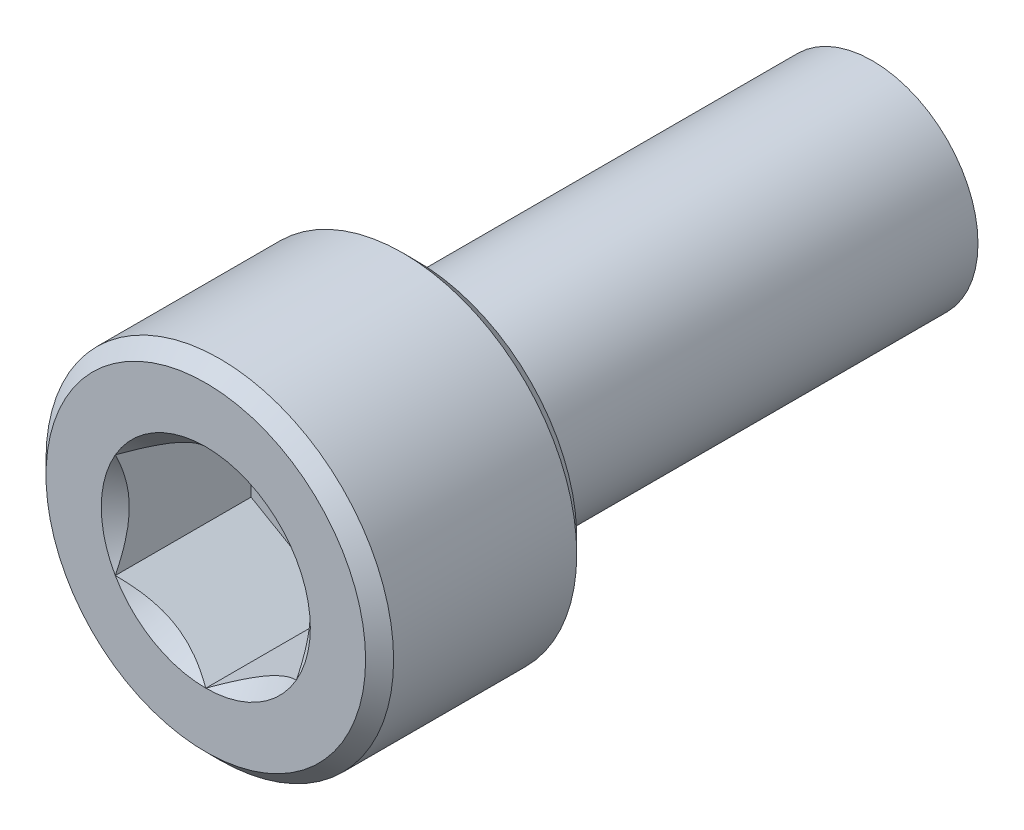
ISO-10303-21;
HEADER;
FILE_DESCRIPTION(('STEP AP214'),'2;1');
FILE_NAME('part.step','',(''),(''),'','','');
FILE_SCHEMA(('AUTOMOTIVE_DESIGN { 1 0 10303 214 1 1 1 1 }'));
ENDSEC;
DATA;
#1=APPLICATION_CONTEXT('core data for automotive mechanical design processes');
#2=APPLICATION_PROTOCOL_DEFINITION('international standard','automotive_design',2000,#1);
#3=PRODUCT_CONTEXT('',#1,'mechanical');
#4=PRODUCT('Part','Part','',(#3));
#5=PRODUCT_RELATED_PRODUCT_CATEGORY('part','',(#4));
#6=PRODUCT_DEFINITION_FORMATION('','',#4);
#7=PRODUCT_DEFINITION_CONTEXT('part definition',#1,'design');
#8=PRODUCT_DEFINITION('design','',#6,#7);
#9=PRODUCT_DEFINITION_SHAPE('','',#8);
#10=(LENGTH_UNIT() NAMED_UNIT(*) SI_UNIT(.MILLI.,.METRE.));
#11=(NAMED_UNIT(*) PLANE_ANGLE_UNIT() SI_UNIT($,.RADIAN.));
#12=(NAMED_UNIT(*) SI_UNIT($,.STERADIAN.) SOLID_ANGLE_UNIT());
#13=UNCERTAINTY_MEASURE_WITH_UNIT(LENGTH_MEASURE(1.E-05),#10,'distance_accuracy_value','');
#14=(GEOMETRIC_REPRESENTATION_CONTEXT(3) GLOBAL_UNCERTAINTY_ASSIGNED_CONTEXT((#13)) GLOBAL_UNIT_ASSIGNED_CONTEXT((#10,
#11,#12)) REPRESENTATION_CONTEXT('',''));
#15=CARTESIAN_POINT('',(0.,0.,0.));
#16=DIRECTION('',(0.,0.,1.));
#17=DIRECTION('',(1.,0.,0.));
#18=AXIS2_PLACEMENT_3D('',#15,#16,#17);
#19=CARTESIAN_POINT('',(10.3682102585368,0.,6.6656));
#20=DIRECTION('',(0.,0.,-1.));
#21=DIRECTION('',(-1.,0.,0.));
#22=AXIS2_PLACEMENT_3D('',#19,#20,#21);
#23=CYLINDRICAL_SURFACE('',#22,3.429);
#24=CARTESIAN_POINT('',(10.3682102585368,0.,2.77628548977578));
#25=DIRECTION('',(0.,0.,-1.));
#26=DIRECTION('',(-1.,0.,0.));
#27=AXIS2_PLACEMENT_3D('',#24,#25,#26);
#28=CIRCLE('',#27,3.429);
#29=CARTESIAN_POINT('',(6.9392102585368,0.,2.77628548977578));
#30=VERTEX_POINT('',#29);
#31=EDGE_CURVE('E249',#30,#30,#28,.F.);
#32=ORIENTED_EDGE('',*,*,#31,.T.);
#33=EDGE_LOOP('',(#32));
#34=FACE_BOUND('',#33,.T.);
#35=CARTESIAN_POINT('',(10.3682102585368,0.,6.38931451022422));
#36=DIRECTION('',(0.,0.,1.));
#37=DIRECTION('',(1.,0.,0.));
#38=AXIS2_PLACEMENT_3D('',#35,#36,#37);
#39=CIRCLE('',#38,3.429);
#40=CARTESIAN_POINT('',(13.7972102585368,0.,6.38931451022422));
#41=VERTEX_POINT('',#40);
#42=EDGE_CURVE('E246',#41,#41,#39,.F.);
#43=ORIENTED_EDGE('',*,*,#42,.T.);
#44=EDGE_LOOP('',(#43));
#45=FACE_BOUND('',#44,.T.);
#46=ADVANCED_FACE('F47',(#34,#45),#23,.T.);
#47=CARTESIAN_POINT('',(13.7972102585368,0.,6.6656));
#48=DIRECTION('',(0.,0.,1.));
#49=DIRECTION('',(1.,0.,0.));
#50=AXIS2_PLACEMENT_3D('',#47,#48,#49);
#51=PLANE('',#50);
#52=CARTESIAN_POINT('',(10.3682102585368,0.,6.6656));
#53=DIRECTION('',(0.,0.,1.));
#54=DIRECTION('',(1.,0.,0.));
#55=AXIS2_PLACEMENT_3D('',#52,#53,#54);
#56=CIRCLE('',#55,3.15271451022421);
#57=CARTESIAN_POINT('',(13.520924768761,0.,6.6656));
#58=VERTEX_POINT('',#57);
#59=EDGE_CURVE('E243',#58,#58,#56,.T.);
#60=ORIENTED_EDGE('',*,*,#59,.T.);
#61=EDGE_LOOP('',(#60));
#62=FACE_BOUND('',#61,.T.);
#63=CARTESIAN_POINT('',(10.3682102585368,0.,6.6656));
#64=DIRECTION('',(0.,0.,1.));
#65=DIRECTION('',(1.,0.,0.));
#66=AXIS2_PLACEMENT_3D('',#63,#64,#65);
#67=CIRCLE('',#66,2.06222298977577);
#68=CARTESIAN_POINT('',(12.1541477585368,-1.03111149638085,6.6656));
#69=VERTEX_POINT('',#68);
#70=CARTESIAN_POINT('',(12.1541477585368,1.03111149040899,6.6656));
#71=VERTEX_POINT('',#70);
#72=EDGE_CURVE('E143',#69,#71,#67,.T.);
#73=ORIENTED_EDGE('',*,*,#72,.F.);
#74=CARTESIAN_POINT('',(10.3682102637086,-2.06222298977577,6.6656));
#75=VERTEX_POINT('',#74);
#76=EDGE_CURVE('E113',#75,#69,#67,.T.);
#77=ORIENTED_EDGE('',*,*,#76,.F.);
#78=CARTESIAN_POINT('',(8.58227275853682,-1.03111149040902,6.6656));
#79=VERTEX_POINT('',#78);
#80=EDGE_CURVE('E106',#79,#75,#67,.T.);
#81=ORIENTED_EDGE('',*,*,#80,.F.);
#82=CARTESIAN_POINT('',(8.58227276370857,1.03111149936676,6.6656));
#83=VERTEX_POINT('',#82);
#84=EDGE_CURVE('E112',#83,#79,#67,.T.);
#85=ORIENTED_EDGE('',*,*,#84,.F.);
#86=CARTESIAN_POINT('',(10.3682102637086,2.06222298977577,6.6656));
#87=VERTEX_POINT('',#86);
#88=EDGE_CURVE('E151',#87,#83,#67,.T.);
#89=ORIENTED_EDGE('',*,*,#88,.F.);
#90=EDGE_CURVE('E146',#71,#87,#67,.T.);
#91=ORIENTED_EDGE('',*,*,#90,.F.);
#92=EDGE_LOOP('',(#73,#77,#81,#85,#89,#91));
#93=FACE_BOUND('',#92,.T.);
#94=ADVANCED_FACE('F140',(#62,#93),#51,.T.);
#95=CARTESIAN_POINT('',(10.3682102585368,0.,2.5));
#96=DIRECTION('',(0.,0.,-1.));
#97=DIRECTION('',(-1.,0.,0.));
#98=AXIS2_PLACEMENT_3D('',#95,#96,#97);
#99=PLANE('',#98);
#100=CARTESIAN_POINT('',(10.3682102585368,0.,2.5));
#101=DIRECTION('',(0.,0.,-1.));
#102=DIRECTION('',(-1.,0.,0.));
#103=AXIS2_PLACEMENT_3D('',#100,#101,#102);
#104=CIRCLE('',#103,3.15271451022422);
#105=CARTESIAN_POINT('',(7.21549574831258,0.,2.5));
#106=VERTEX_POINT('',#105);
#107=EDGE_CURVE('E250',#106,#106,#104,.T.);
#108=ORIENTED_EDGE('',*,*,#107,.T.);
#109=EDGE_LOOP('',(#108));
#110=FACE_BOUND('',#109,.T.);
#111=CARTESIAN_POINT('',(10.3682102585368,0.,2.5));
#112=DIRECTION('',(0.,0.,-1.));
#113=DIRECTION('',(-1.,0.,0.));
#114=AXIS2_PLACEMENT_3D('',#111,#112,#113);
#115=CIRCLE('',#114,2.08280000001);
#116=CARTESIAN_POINT('',(8.2854102585268,0.,2.5));
#117=VERTEX_POINT('',#116);
#118=EDGE_CURVE('E137',#117,#117,#115,.T.);
#119=ORIENTED_EDGE('',*,*,#118,.F.);
#120=EDGE_LOOP('',(#119));
#121=FACE_BOUND('',#120,.T.);
#122=ADVANCED_FACE('F214',(#110,#121),#99,.T.);
#123=CARTESIAN_POINT('',(10.3682102585368,0.,-7.025));
#124=DIRECTION('',(0.,0.,1.));
#125=DIRECTION('',(1.,0.,0.));
#126=AXIS2_PLACEMENT_3D('',#123,#124,#125);
#127=CYLINDRICAL_SURFACE('',#126,2.08280000001);
#128=CARTESIAN_POINT('',(10.3682102585368,0.,-6.48615126404115));
#129=DIRECTION('',(0.,0.,-1.));
#130=DIRECTION('',(-1.,0.,0.));
#131=AXIS2_PLACEMENT_3D('',#128,#129,#130);
#132=CIRCLE('',#131,2.08280000001);
#133=CARTESIAN_POINT('',(8.2854102585268,0.,-6.48615126404115));
#134=VERTEX_POINT('',#133);
#135=EDGE_CURVE('E63',#134,#134,#132,.F.);
#136=ORIENTED_EDGE('',*,*,#135,.T.);
#137=EDGE_LOOP('',(#136));
#138=FACE_BOUND('',#137,.T.);
#139=ORIENTED_EDGE('',*,*,#118,.T.);
#140=EDGE_LOOP('',(#139));
#141=FACE_BOUND('',#140,.T.);
#142=ADVANCED_FACE('F210',(#138,#141),#127,.T.);
#143=CARTESIAN_POINT('',(10.3682102585368,0.,-7.025));
#144=DIRECTION('',(0.,0.,-1.));
#145=DIRECTION('',(-1.,0.,0.));
#146=AXIS2_PLACEMENT_3D('',#143,#144,#145);
#147=PLANE('',#146);
#148=CARTESIAN_POINT('',(10.3682102585368,0.,-7.025));
#149=DIRECTION('',(0.,0.,-1.));
#150=DIRECTION('',(-1.,0.,0.));
#151=AXIS2_PLACEMENT_3D('',#148,#149,#150);
#152=CIRCLE('',#151,1.31324425181486);
#153=CARTESIAN_POINT('',(9.05496600672194,0.,-7.025));
#154=VERTEX_POINT('',#153);
#155=EDGE_CURVE('E262',#154,#154,#152,.T.);
#156=ORIENTED_EDGE('',*,*,#155,.T.);
#157=EDGE_LOOP('',(#156));
#158=FACE_BOUND('',#157,.T.);
#159=ADVANCED_FACE('F206',(#158),#147,.T.);
#160=CARTESIAN_POINT('',(10.3682102585368,0.,2.5));
#161=DIRECTION('',(0.,0.,1.));
#162=DIRECTION('',(1.,0.,0.));
#163=AXIS2_PLACEMENT_3D('',#160,#161,#162);
#164=CONICAL_SURFACE('',#163,3.15271451022422,0.785398163397439);
#165=ORIENTED_EDGE('',*,*,#31,.F.);
#166=EDGE_LOOP('',(#165));
#167=FACE_BOUND('',#166,.T.);
#168=ORIENTED_EDGE('',*,*,#107,.F.);
#169=EDGE_LOOP('',(#168));
#170=FACE_BOUND('',#169,.T.);
#171=ADVANCED_FACE('F209',(#167,#170),#164,.T.);
#172=CARTESIAN_POINT('',(10.3682102585368,0.,6.38931451022422));
#173=DIRECTION('',(0.,0.,-1.));
#174=DIRECTION('',(-1.,0.,0.));
#175=AXIS2_PLACEMENT_3D('',#172,#173,#174);
#176=CONICAL_SURFACE('',#175,3.429,0.785398163397455);
#177=ORIENTED_EDGE('',*,*,#59,.F.);
#178=EDGE_LOOP('',(#177));
#179=FACE_BOUND('',#178,.T.);
#180=ORIENTED_EDGE('',*,*,#42,.F.);
#181=EDGE_LOOP('',(#180));
#182=FACE_BOUND('',#181,.T.);
#183=ADVANCED_FACE('F230',(#179,#182),#176,.T.);
#184=CARTESIAN_POINT('',(10.3682102585368,0.,-7.025));
#185=DIRECTION('',(0.,0.,1.));
#186=DIRECTION('',(1.,0.,0.));
#187=AXIS2_PLACEMENT_3D('',#184,#185,#186);
#188=CONICAL_SURFACE('',#187,1.31324425181486,0.959931088596887);
#189=ORIENTED_EDGE('',*,*,#135,.F.);
#190=EDGE_LOOP('',(#189));
#191=FACE_BOUND('',#190,.T.);
#192=ORIENTED_EDGE('',*,*,#155,.F.);
#193=EDGE_LOOP('',(#192));
#194=FACE_BOUND('',#193,.T.);
#195=ADVANCED_FACE('F50',(#191,#194),#188,.T.);
#196=CARTESIAN_POINT('',(10.3682102585368,0.,6.38931451022422));
#197=DIRECTION('',(0.,0.,1.));
#198=DIRECTION('',(1.,0.,0.));
#199=AXIS2_PLACEMENT_3D('',#196,#197,#198);
#200=CONICAL_SURFACE('',#199,1.78593749999998,0.785398163397455);
#201=ORIENTED_EDGE('',*,*,#76,.T.);
#202=CARTESIAN_POINT('',(12.1543477585368,-1.03099602632701,6.6657154827375));
#203=CARTESIAN_POINT('',(12.0929521569609,-1.06644279342393,6.63029683319124));
#204=CARTESIAN_POINT('',(12.0305298976627,-1.10248230163315,6.5969581811368));
#205=CARTESIAN_POINT('',(11.9032437980009,-1.17597096553699,6.53591556219142));
#206=CARTESIAN_POINT('',(11.8383678487385,-1.21342711230756,6.50824556511107));
#207=CARTESIAN_POINT('',(11.7075485492251,-1.28895567009684,6.46084612953868));
#208=CARTESIAN_POINT('',(11.6416385250233,-1.32700884031206,6.44099753727204));
#209=CARTESIAN_POINT('',(11.5083672808544,-1.40395302900819,6.41041648460021));
#210=CARTESIAN_POINT('',(11.4410101336792,-1.44284169606166,6.39966119162716));
#211=CARTESIAN_POINT('',(11.3249269378662,-1.50986236041265,6.38995725894482));
#212=CARTESIAN_POINT('',(11.2763509098501,-1.53790774326391,6.38852054843898));
#213=CARTESIAN_POINT('',(11.179278218193,-1.59395268792309,6.39093945077469));
#214=CARTESIAN_POINT('',(11.1307815883455,-1.62195223022035,6.39479691915739));
#215=CARTESIAN_POINT('',(11.0342595800686,-1.67767923768175,6.40758288572986));
#216=CARTESIAN_POINT('',(10.9862346334386,-1.70540645354637,6.4165156567014));
#217=CARTESIAN_POINT('',(10.8909885352986,-1.76039681394678,6.43896731712816));
#218=CARTESIAN_POINT('',(10.8437677776237,-1.78765973110171,6.45248838942398));
#219=CARTESIAN_POINT('',(10.7228248098806,-1.85748618608481,6.49262737762003));
#220=CARTESIAN_POINT('',(10.6498524648244,-1.89961678914641,6.52227078689287));
#221=CARTESIAN_POINT('',(10.5425533307974,-1.96156597306072,6.57231349323997));
#222=CARTESIAN_POINT('',(10.5071935168227,-1.98198097117749,6.5898962867599));
#223=CARTESIAN_POINT('',(10.4371289780146,-2.022432751519,6.626664772134));
#224=CARTESIAN_POINT('',(10.4024238665824,-2.04246975694661,6.64584947927489));
#225=CARTESIAN_POINT('',(10.3680102585368,-2.06233846281554,6.6657154827375));
#226=B_SPLINE_CURVE_WITH_KNOTS('',3,(#202,#203,#204,#205,#206,#207,#208,#209,#210,#211,#212,
#213,#214,#215,#216,#217,#218,#219,#220,#221,#222,#223,#224,#225),.UNSPECIFIED.,.F.,.F.,(4,2,2,
2,2,2,2,2,2,2,2,4),(0.,0.237911140423799,0.477208767673628,0.712705150046278,0.947608448198474,
1.11569769827264,1.28384587649987,1.45213582505428,1.62050594845157,1.8879149571291,
2.02125696737758,2.15451760593925),.UNSPECIFIED.);
#227=EDGE_CURVE('E11',#69,#75,#226,.T.);
#228=ORIENTED_EDGE('',*,*,#227,.T.);
#229=EDGE_LOOP('',(#201,#228));
#230=FACE_BOUND('',#229,.T.);
#231=ADVANCED_FACE('F118',(#230),#200,.F.);
#232=CARTESIAN_POINT('',(12.1541477585368,3.11195979528571,8.19139408395462));
#233=CARTESIAN_POINT('',(12.1541477585368,3.01990367500785,8.11158331150942));
#234=CARTESIAN_POINT('',(12.1541477585368,2.92743807567578,8.03223509428488));
#235=CARTESIAN_POINT('',(12.1541477585368,2.74137043734948,7.87479361340831));
#236=CARTESIAN_POINT('',(12.1541477585368,2.6477678785586,7.79670096484113));
#237=CARTESIAN_POINT('',(12.1541477585368,2.45702638209181,7.64039930080439));
#238=CARTESIAN_POINT('',(12.1541477585368,2.3598556313173,7.56222895539277));
#239=CARTESIAN_POINT('',(12.1541477585368,2.16368094944951,7.40826293305869));
#240=CARTESIAN_POINT('',(12.1541477585368,2.06467748398763,7.33246666578706));
#241=CARTESIAN_POINT('',(12.1541477585368,1.86409754720655,7.18404857601127));
#242=CARTESIAN_POINT('',(12.1541477585368,1.76251780222061,7.11143114864639));
#243=CARTESIAN_POINT('',(12.1541477585368,1.55601273525328,6.97086755090839));
#244=CARTESIAN_POINT('',(12.1541477585368,1.45108477022526,6.90292521156009));
#245=CARTESIAN_POINT('',(12.1541477585368,1.23773498155917,6.77462768521841));
#246=CARTESIAN_POINT('',(12.1541477585368,1.12934637450445,6.7142179868661));
#247=CARTESIAN_POINT('',(12.1541477585368,0.907220795816614,6.60421412784857));
#248=CARTESIAN_POINT('',(12.1541477585368,0.793494142364182,6.55460006803931));
#249=CARTESIAN_POINT('',(12.1541477585368,0.617125489765613,6.49211098855723));
#250=CARTESIAN_POINT('',(12.1541477585368,0.556658301309069,6.47312666807994));
#251=CARTESIAN_POINT('',(12.1541477585368,0.434300098843672,6.44041700993573));
#252=CARTESIAN_POINT('',(12.1541477585368,0.372409313770313,6.42669083286289));
#253=CARTESIAN_POINT('',(12.1541477585368,0.247949404368907,6.40540948039067));
#254=CARTESIAN_POINT('',(12.1541477585368,0.185386829401842,6.39781671960764));
#255=CARTESIAN_POINT('',(12.1541477585368,0.0598067058906999,6.38921813963633));
#256=CARTESIAN_POINT('',(12.1541477585368,-0.00321079415183164,6.38821162834628));
#257=CARTESIAN_POINT('',(12.1541477585368,-0.129075846581472,6.39286621072103));
#258=CARTESIAN_POINT('',(12.1541477585368,-0.191923069543148,6.39853601377289));
#259=CARTESIAN_POINT('',(12.1541477585368,-0.316729645052868,6.41612856509637));
#260=CARTESIAN_POINT('',(12.1541477585368,-0.378688820279614,6.42805254478494));
#261=CARTESIAN_POINT('',(12.1541477585368,-0.501709993373726,6.45747747332408));
#262=CARTESIAN_POINT('',(12.1541477585368,-0.562762501291539,6.47501740730654));
#263=CARTESIAN_POINT('',(12.1541477585368,-0.683319324012498,6.51472629453872));
#264=CARTESIAN_POINT('',(12.1541477585368,-0.742823621637391,6.53689529912593));
#265=CARTESIAN_POINT('',(12.1541477585368,-0.873520719753164,6.59040871879499));
#266=CARTESIAN_POINT('',(12.1541477585368,-0.944324639047422,6.62269495294738));
#267=CARTESIAN_POINT('',(12.1541477585368,-1.08382392055396,6.69157383841638));
#268=CARTESIAN_POINT('',(12.1541477585368,-1.15251803541147,6.72816897771088));
#269=CARTESIAN_POINT('',(12.1541477585368,-1.28818761165869,6.804707446721));
#270=CARTESIAN_POINT('',(12.1541477585368,-1.35515921795505,6.84465755538433));
#271=CARTESIAN_POINT('',(12.1541477585368,-1.48750479672668,6.92707507527218));
#272=CARTESIAN_POINT('',(12.1541477585368,-1.55287908333146,6.96954198582168));
#273=CARTESIAN_POINT('',(12.1541477585368,-1.74771848747143,7.10032013108359));
#274=CARTESIAN_POINT('',(12.1541477585368,-1.87519086261617,7.19159238070215));
#275=CARTESIAN_POINT('',(12.1541477585368,-2.12627815511178,7.37893318342417));
#276=CARTESIAN_POINT('',(12.1541477585368,-2.24989714172735,7.47499637766338));
#277=CARTESIAN_POINT('',(12.1541477585368,-2.49846791064479,7.67358026411443));
#278=CARTESIAN_POINT('',(12.1541477585368,-2.62333281790994,7.77620934578542));
#279=CARTESIAN_POINT('',(12.1541477585368,-2.80843127773327,7.93140315980547));
#280=CARTESIAN_POINT('',(12.1541477585368,-2.86943550423009,7.98305606368835));
#281=CARTESIAN_POINT('',(12.1541477585368,-2.99100758868655,8.08686663166253));
#282=CARTESIAN_POINT('',(12.1541477585368,-3.05157546950531,8.13902426897161));
#283=CARTESIAN_POINT('',(12.1541477585368,-3.11195979528585,8.19139408395444));
#284=B_SPLINE_CURVE_WITH_KNOTS('',3,(#232,#233,#234,#235,#236,#237,#238,#239,#240,#241,#242,
#243,#244,#245,#246,#247,#248,#249,#250,#251,#252,#253,#254,#255,#256,#257,#258,#259,#260,#261,
#262,#263,#264,#265,#266,#267,#268,#269,#270,#271,#272,#273,#274,#275,#276,#277,#278,#279,#280,
#281,#282,#283),.UNSPECIFIED.,.F.,.F.,(4,2,2,2,2,2,2,2,2,2,2,2,2,2,2,2,2,2,2,2,2,2,2,2,2,4),(0.,
0.365516966084932,0.73120784916355,1.10531335505455,1.47932508345506,1.85383857261327,
2.22865539129358,2.60057932366571,2.97181178524552,3.16175399731955,3.3516658745176,
3.54040495612978,3.72912420418562,3.91808991330528,4.10709284282816,4.29743733450777,
4.48778393726527,4.72103899473884,4.95442940117966,5.18830329082253,5.42213081038426,
5.89224850671793,6.36185166183893,6.84669015066562,7.08649225645943,7.32628170687079),.UNSPECIFIED.);
#285=EDGE_CURVE('E150',#71,#69,#284,.T.);
#286=ORIENTED_EDGE('',*,*,#285,.T.);
#287=ORIENTED_EDGE('',*,*,#72,.T.);
#288=EDGE_LOOP('',(#286,#287));
#289=FACE_BOUND('',#288,.T.);
#290=ADVANCED_FACE('F332',(#289),#200,.F.);
#291=CARTESIAN_POINT('',(10.3680102585368,2.06233846281554,6.6657154827375));
#292=CARTESIAN_POINT('',(10.4294058601127,2.02689169571862,6.63029683319124));
#293=CARTESIAN_POINT('',(10.4918281194109,1.9908521875094,6.59695818113681));
#294=CARTESIAN_POINT('',(10.6191142190727,1.91736352360556,6.53591556219142));
#295=CARTESIAN_POINT('',(10.6839901683351,1.87990737683499,6.50824556511107));
#296=CARTESIAN_POINT('',(10.8148094678485,1.8043788190457,6.46084612953868));
#297=CARTESIAN_POINT('',(10.8807194920503,1.76632564883049,6.44099753727204));
#298=CARTESIAN_POINT('',(11.0139907362192,1.68938146013436,6.41041648460021));
#299=CARTESIAN_POINT('',(11.0813478833944,1.65049279308089,6.39966119162716));
#300=CARTESIAN_POINT('',(11.1974310792074,1.58347212872989,6.38995725894482));
#301=CARTESIAN_POINT('',(11.2460071072235,1.55542674587864,6.38852054843898));
#302=CARTESIAN_POINT('',(11.3430797988806,1.49938180121945,6.39093945077469));
#303=CARTESIAN_POINT('',(11.3915764287281,1.47138225892219,6.39479691915739));
#304=CARTESIAN_POINT('',(11.488098437005,1.41565525146079,6.40758288572986));
#305=CARTESIAN_POINT('',(11.536123383635,1.38792803559618,6.4165156567014));
#306=CARTESIAN_POINT('',(11.631369481775,1.33293767519576,6.43896731712816));
#307=CARTESIAN_POINT('',(11.6785902394499,1.30567475804083,6.45248838942398));
#308=CARTESIAN_POINT('',(11.799533207193,1.23584830305774,6.49262737762002));
#309=CARTESIAN_POINT('',(11.8725055522492,1.19371769999614,6.52227078689287));
#310=CARTESIAN_POINT('',(11.9798046862762,1.13176851608183,6.57231349323997));
#311=CARTESIAN_POINT('',(12.0151645002509,1.11135351796506,6.5898962867599));
#312=CARTESIAN_POINT('',(12.085229039059,1.07090173762355,6.626664772134));
#313=CARTESIAN_POINT('',(12.1199341504912,1.05086473219594,6.64584947927489));
#314=CARTESIAN_POINT('',(12.1543477585368,1.03099602632701,6.6657154827375));
#315=B_SPLINE_CURVE_WITH_KNOTS('',3,(#291,#292,#293,#294,#295,#296,#297,#298,#299,#300,#301,
#302,#303,#304,#305,#306,#307,#308,#309,#310,#311,#312,#313,#314),.UNSPECIFIED.,.F.,.F.,(4,2,2,
2,2,2,2,2,2,2,2,4),(0.,0.237911140423802,0.477208767673635,0.712705150046287,0.947608448198485,
1.11569769827265,1.28384587649988,1.45213582505429,1.62050594845158,1.8879149571291,
2.02125696737759,2.15451760593925),.UNSPECIFIED.);
#316=EDGE_CURVE('E159',#87,#71,#315,.T.);
#317=ORIENTED_EDGE('',*,*,#316,.T.);
#318=ORIENTED_EDGE('',*,*,#90,.T.);
#319=EDGE_LOOP('',(#317,#318));
#320=FACE_BOUND('',#319,.T.);
#321=ADVANCED_FACE('F329',(#320),#200,.F.);
#322=CARTESIAN_POINT('',(8.58207275853682,1.03099602632701,6.66571548273748));
#323=CARTESIAN_POINT('',(8.64346836011273,1.06644279342393,6.63029683319122));
#324=CARTESIAN_POINT('',(8.7058906194109,1.10248230163315,6.59695818113679));
#325=CARTESIAN_POINT('',(8.8331767190727,1.17597096553699,6.53591556219141));
#326=CARTESIAN_POINT('',(8.89805266833508,1.21342711230756,6.50824556511106));
#327=CARTESIAN_POINT('',(9.02887196784853,1.28895567009684,6.46084612953867));
#328=CARTESIAN_POINT('',(9.09478199205035,1.32700884031206,6.44099753727203));
#329=CARTESIAN_POINT('',(9.22805323621921,1.40395302900819,6.4104164846002));
#330=CARTESIAN_POINT('',(9.29541038339444,1.44284169606165,6.39966119162715));
#331=CARTESIAN_POINT('',(9.41149357920738,1.50986236041265,6.38995725894481));
#332=CARTESIAN_POINT('',(9.46006960722348,1.5379077432639,6.38852054843898));
#333=CARTESIAN_POINT('',(9.55714229888057,1.59395268792309,6.39093945077468));
#334=CARTESIAN_POINT('',(9.6056389287281,1.62195223022035,6.39479691915738));
#335=CARTESIAN_POINT('',(9.70216093700501,1.67767923768175,6.40758288572986));
#336=CARTESIAN_POINT('',(9.75018588363495,1.70540645354636,6.4165156567014));
#337=CARTESIAN_POINT('',(9.84543198177499,1.76039681394678,6.43896731712815));
#338=CARTESIAN_POINT('',(9.89265273944987,1.78765973110171,6.45248838942397));
#339=CARTESIAN_POINT('',(10.013595707193,1.85748618608481,6.49262737762002));
#340=CARTESIAN_POINT('',(10.0865680522492,1.89961678914641,6.52227078689287));
#341=CARTESIAN_POINT('',(10.1938671862762,1.96156597306072,6.57231349323997));
#342=CARTESIAN_POINT('',(10.2292270002509,1.98198097117749,6.5898962867599));
#343=CARTESIAN_POINT('',(10.299291539059,2.022432751519,6.626664772134));
#344=CARTESIAN_POINT('',(10.3339966504912,2.04246975694661,6.64584947927489));
#345=CARTESIAN_POINT('',(10.3684102585368,2.06233846281554,6.6657154827375));
#346=B_SPLINE_CURVE_WITH_KNOTS('',3,(#322,#323,#324,#325,#326,#327,#328,#329,#330,#331,#332,
#333,#334,#335,#336,#337,#338,#339,#340,#341,#342,#343,#344,#345),.UNSPECIFIED.,.F.,.F.,(4,2,2,
2,2,2,2,2,2,2,2,4),(0.,0.237911140423795,0.47720876767362,0.712705150046265,0.947608448198455,
1.11569769827262,1.28384587649985,1.45213582505426,1.62050594845155,1.88791495712908,
2.02125696737757,2.15451760593923),.UNSPECIFIED.);
#347=EDGE_CURVE('E178',#83,#87,#346,.T.);
#348=ORIENTED_EDGE('',*,*,#347,.T.);
#349=ORIENTED_EDGE('',*,*,#88,.T.);
#350=EDGE_LOOP('',(#348,#349));
#351=FACE_BOUND('',#350,.T.);
#352=ADVANCED_FACE('F323',(#351),#200,.F.);
#353=CARTESIAN_POINT('',(8.58227275853682,-3.11195979528571,8.19139408395461));
#354=CARTESIAN_POINT('',(8.58227275853682,-3.01990367500785,8.11158331150941));
#355=CARTESIAN_POINT('',(8.58227275853682,-2.92743807567578,8.03223509428487));
#356=CARTESIAN_POINT('',(8.58227275853682,-2.74137043734948,7.8747936134083));
#357=CARTESIAN_POINT('',(8.58227275853682,-2.6477678785586,7.79670096484112));
#358=CARTESIAN_POINT('',(8.58227275853682,-2.45702638209181,7.64039930080438));
#359=CARTESIAN_POINT('',(8.58227275853682,-2.3598556313173,7.56222895539276));
#360=CARTESIAN_POINT('',(8.58227275853682,-2.16368094944951,7.40826293305868));
#361=CARTESIAN_POINT('',(8.58227275853682,-2.06467748398763,7.33246666578705));
#362=CARTESIAN_POINT('',(8.58227275853682,-1.86409754720655,7.18404857601126));
#363=CARTESIAN_POINT('',(8.58227275853682,-1.76251780222062,7.11143114864638));
#364=CARTESIAN_POINT('',(8.58227275853682,-1.55601273525329,6.97086755090838));
#365=CARTESIAN_POINT('',(8.58227275853682,-1.45108477022527,6.90292521156008));
#366=CARTESIAN_POINT('',(8.58227275853682,-1.23773498155918,6.7746276852184));
#367=CARTESIAN_POINT('',(8.58227275853682,-1.12934637450446,6.71421798686609));
#368=CARTESIAN_POINT('',(8.58227275853682,-0.907220795816622,6.60421412784856));
#369=CARTESIAN_POINT('',(8.58227275853682,-0.793494142364191,6.5546000680393));
#370=CARTESIAN_POINT('',(8.58227275853682,-0.617125489765622,6.49211098855722));
#371=CARTESIAN_POINT('',(8.58227275853682,-0.556658301309078,6.47312666807993));
#372=CARTESIAN_POINT('',(8.58227275853682,-0.434300098843681,6.44041700993572));
#373=CARTESIAN_POINT('',(8.58227275853682,-0.372409313770322,6.42669083286287));
#374=CARTESIAN_POINT('',(8.58227275853682,-0.247949404368917,6.40540948039065));
#375=CARTESIAN_POINT('',(8.58227275853682,-0.185386829401852,6.39781671960762));
#376=CARTESIAN_POINT('',(8.58227275853682,-0.0598067058907104,6.38921813963631));
#377=CARTESIAN_POINT('',(8.58227275853682,0.00321079415182119,6.38821162834626));
#378=CARTESIAN_POINT('',(8.58227275853682,0.129075846581461,6.39286621072101));
#379=CARTESIAN_POINT('',(8.58227275853682,0.191923069543138,6.39853601377287));
#380=CARTESIAN_POINT('',(8.58227275853682,0.316729645052857,6.41612856509635));
#381=CARTESIAN_POINT('',(8.58227275853682,0.378688820279604,6.42805254478492));
#382=CARTESIAN_POINT('',(8.58227275853682,0.501709993373715,6.45747747332405));
#383=CARTESIAN_POINT('',(8.58227275853682,0.562762501291528,6.47501740730651));
#384=CARTESIAN_POINT('',(8.58227275853682,0.683319324012487,6.5147262945387));
#385=CARTESIAN_POINT('',(8.58227275853682,0.74282362163738,6.53689529912591));
#386=CARTESIAN_POINT('',(8.58227275853682,0.873520719753152,6.59040871879497));
#387=CARTESIAN_POINT('',(8.58227275853682,0.944324639047409,6.62269495294736));
#388=CARTESIAN_POINT('',(8.58227275853682,1.08382392055395,6.69157383841636));
#389=CARTESIAN_POINT('',(8.58227275853682,1.15251803541146,6.72816897771086));
#390=CARTESIAN_POINT('',(8.58227275853682,1.28818761165867,6.80470744672098));
#391=CARTESIAN_POINT('',(8.58227275853682,1.35515921795503,6.8446575553843));
#392=CARTESIAN_POINT('',(8.58227275853682,1.48750479672666,6.92707507527216));
#393=CARTESIAN_POINT('',(8.58227275853682,1.55287908333144,6.96954198582165));
#394=CARTESIAN_POINT('',(8.58227275853682,1.7477184874714,7.10032013108356));
#395=CARTESIAN_POINT('',(8.58227275853682,1.87519086261614,7.19159238070212));
#396=CARTESIAN_POINT('',(8.58227275853682,2.12627815511175,7.37893318342414));
#397=CARTESIAN_POINT('',(8.58227275853682,2.24989714172732,7.47499637766334));
#398=CARTESIAN_POINT('',(8.58227275853682,2.49846791064476,7.6735802641144));
#399=CARTESIAN_POINT('',(8.58227275853682,2.62333281790992,7.77620934578539));
#400=CARTESIAN_POINT('',(8.58227275853682,2.80843127773325,7.93140315980545));
#401=CARTESIAN_POINT('',(8.58227275853682,2.86943550423008,7.98305606368833));
#402=CARTESIAN_POINT('',(8.58227275853682,2.99100758868654,8.08686663166251));
#403=CARTESIAN_POINT('',(8.58227275853682,3.05157546950531,8.13902426897159));
#404=CARTESIAN_POINT('',(8.58227275853682,3.11195979528585,8.19139408395443));
#405=B_SPLINE_CURVE_WITH_KNOTS('',3,(#353,#354,#355,#356,#357,#358,#359,#360,#361,#362,#363,
#364,#365,#366,#367,#368,#369,#370,#371,#372,#373,#374,#375,#376,#377,#378,#379,#380,#381,#382,
#383,#384,#385,#386,#387,#388,#389,#390,#391,#392,#393,#394,#395,#396,#397,#398,#399,#400,#401,
#402,#403,#404),.UNSPECIFIED.,.F.,.F.,(4,2,2,2,2,2,2,2,2,2,2,2,2,2,2,2,2,2,2,2,2,2,2,2,2,4),(0.,
0.365516966084932,0.73120784916355,1.10531335505455,1.47932508345506,1.85383857261327,
2.22865539129358,2.6005793236657,2.97181178524551,3.16175399731954,3.35166587451759,
3.54040495612978,3.72912420418561,3.91808991330527,4.10709284282815,4.29743733450776,
4.48778393726526,4.72103899473883,4.95442940117965,5.18830329082251,5.42213081038424,
5.8922485067179,6.3618516618389,6.8466901506656,7.08649225645943,7.3262817068708),.UNSPECIFIED.);
#406=EDGE_CURVE('E75',#79,#83,#405,.T.);
#407=ORIENTED_EDGE('',*,*,#406,.T.);
#408=ORIENTED_EDGE('',*,*,#84,.T.);
#409=EDGE_LOOP('',(#407,#408));
#410=FACE_BOUND('',#409,.T.);
#411=ADVANCED_FACE('F172',(#410),#200,.F.);
#412=CARTESIAN_POINT('',(10.3684102585368,-2.06233846281554,6.6657154827375));
#413=CARTESIAN_POINT('',(10.3070146569609,-2.02689169571862,6.63029683319124));
#414=CARTESIAN_POINT('',(10.2445923976627,-1.9908521875094,6.59695818113681));
#415=CARTESIAN_POINT('',(10.1173062980009,-1.91736352360556,6.53591556219142));
#416=CARTESIAN_POINT('',(10.0524303487385,-1.87990737683499,6.50824556511107));
#417=CARTESIAN_POINT('',(9.92161104922508,-1.8043788190457,6.46084612953868));
#418=CARTESIAN_POINT('',(9.85570102502326,-1.76632564883049,6.44099753727204));
#419=CARTESIAN_POINT('',(9.72242978085439,-1.68938146013435,6.4104164846002));
#420=CARTESIAN_POINT('',(9.65507263367915,-1.65049279308088,6.39966119162715));
#421=CARTESIAN_POINT('',(9.53898943786621,-1.58347212872989,6.38995725894481));
#422=CARTESIAN_POINT('',(9.49041340985011,-1.55542674587863,6.38852054843898));
#423=CARTESIAN_POINT('',(9.39334071819302,-1.49938180121944,6.39093945077468));
#424=CARTESIAN_POINT('',(9.3448440883455,-1.47138225892219,6.39479691915738));
#425=CARTESIAN_POINT('',(9.24832208006858,-1.41565525146078,6.40758288572985));
#426=CARTESIAN_POINT('',(9.20029713343864,-1.38792803559617,6.41651565670139));
#427=CARTESIAN_POINT('',(9.1050510352986,-1.33293767519576,6.43896731712815));
#428=CARTESIAN_POINT('',(9.05783027762372,-1.30567475804083,6.45248838942397));
#429=CARTESIAN_POINT('',(8.93688730988058,-1.23584830305773,6.49262737762002));
#430=CARTESIAN_POINT('',(8.86391496482437,-1.19371769999613,6.52227078689286));
#431=CARTESIAN_POINT('',(8.75661583079737,-1.13176851608183,6.57231349323995));
#432=CARTESIAN_POINT('',(8.7212560168227,-1.11135351796506,6.58989628675988));
#433=CARTESIAN_POINT('',(8.65119147801459,-1.07090173762354,6.62666477213399));
#434=CARTESIAN_POINT('',(8.61648636658244,-1.05086473219594,6.64584947927488));
#435=CARTESIAN_POINT('',(8.58207275853682,-1.03099602632701,6.66571548273748));
#436=B_SPLINE_CURVE_WITH_KNOTS('',3,(#412,#413,#414,#415,#416,#417,#418,#419,#420,#421,#422,
#423,#424,#425,#426,#427,#428,#429,#430,#431,#432,#433,#434,#435),.UNSPECIFIED.,.F.,.F.,(4,2,2,
2,2,2,2,2,2,2,2,4),(0.,0.237911140423805,0.477208767673637,0.71270515004629,0.947608448198493,
1.11569769827266,1.28384587649989,1.45213582505429,1.62050594845159,1.8879149571291,
2.02125696737757,2.15451760593923),.UNSPECIFIED.);
#437=EDGE_CURVE('E69',#75,#79,#436,.T.);
#438=ORIENTED_EDGE('',*,*,#437,.T.);
#439=ORIENTED_EDGE('',*,*,#80,.T.);
#440=EDGE_LOOP('',(#438,#439));
#441=FACE_BOUND('',#440,.T.);
#442=ADVANCED_FACE('F107',(#441),#200,.F.);
#443=CARTESIAN_POINT('',(0.,0.,3.98669375));
#444=DIRECTION('',(0.,0.,-1.));
#445=DIRECTION('',(-1.,0.,0.));
#446=AXIS2_PLACEMENT_3D('',#443,#444,#445);
#447=PLANE('',#446);
#448=DIRECTION('',(-0.866025403784438,-0.500000000000001,0.));
#449=VECTOR('',#448,1.);
#450=CARTESIAN_POINT('',(12.1541477585368,-1.03111149638085,3.98669375));
#451=LINE('',#450,#449);
#452=CARTESIAN_POINT('',(12.1541477585368,-1.03111149638085,3.98669375));
#453=VERTEX_POINT('',#452);
#454=CARTESIAN_POINT('',(10.3682102585368,-2.0622229927617,3.98669375));
#455=VERTEX_POINT('',#454);
#456=EDGE_CURVE('E131',#453,#455,#451,.T.);
#457=ORIENTED_EDGE('',*,*,#456,.F.);
#458=DIRECTION('',(0.,-1.,0.));
#459=VECTOR('',#458,1.);
#460=CARTESIAN_POINT('',(12.1541477585368,1.03111149638085,3.98669375));
#461=LINE('',#460,#459);
#462=CARTESIAN_POINT('',(12.1541477585368,1.03111149638085,3.98669375));
#463=VERTEX_POINT('',#462);
#464=EDGE_CURVE('E279',#463,#453,#461,.T.);
#465=ORIENTED_EDGE('',*,*,#464,.F.);
#466=DIRECTION('',(0.866025403784438,-0.500000000000001,0.));
#467=VECTOR('',#466,1.);
#468=CARTESIAN_POINT('',(10.3682102585368,2.0622229927617,3.98669375));
#469=LINE('',#468,#467);
#470=CARTESIAN_POINT('',(10.3682102585368,2.0622229927617,3.98669375));
#471=VERTEX_POINT('',#470);
#472=EDGE_CURVE('E303',#471,#463,#469,.T.);
#473=ORIENTED_EDGE('',*,*,#472,.F.);
#474=DIRECTION('',(0.866025403784435,0.500000000000005,0.));
#475=VECTOR('',#474,1.);
#476=CARTESIAN_POINT('',(8.58227275853682,1.03111149638085,3.98669375));
#477=LINE('',#476,#475);
#478=CARTESIAN_POINT('',(8.58227275853682,1.03111149638085,3.98669375));
#479=VERTEX_POINT('',#478);
#480=EDGE_CURVE('E299',#479,#471,#477,.T.);
#481=ORIENTED_EDGE('',*,*,#480,.F.);
#482=DIRECTION('',(0.,1.,0.));
#483=VECTOR('',#482,1.);
#484=CARTESIAN_POINT('',(8.58227275853682,-1.03111149638085,3.98669375));
#485=LINE('',#484,#483);
#486=CARTESIAN_POINT('',(8.58227275853682,-1.03111149638085,3.98669375));
#487=VERTEX_POINT('',#486);
#488=EDGE_CURVE('E295',#487,#479,#485,.T.);
#489=ORIENTED_EDGE('',*,*,#488,.F.);
#490=DIRECTION('',(-0.866025403784435,0.500000000000005,0.));
#491=VECTOR('',#490,1.);
#492=CARTESIAN_POINT('',(10.3682102585368,-2.0622229927617,3.98669375));
#493=LINE('',#492,#491);
#494=EDGE_CURVE('E292',#455,#487,#493,.T.);
#495=ORIENTED_EDGE('',*,*,#494,.F.);
#496=EDGE_LOOP('',(#457,#465,#473,#481,#489,#495));
#497=FACE_BOUND('',#496,.T.);
#498=ADVANCED_FACE('F171',(#497),#447,.F.);
#499=CARTESIAN_POINT('',(12.1541477585368,-1.03111149638085,12.1217291868068));
#500=DIRECTION('',(0.500000000000001,-0.866025403784438,0.));
#501=DIRECTION('',(0.866025403784438,0.500000000000001,0.));
#502=AXIS2_PLACEMENT_3D('',#499,#500,#501);
#503=PLANE('',#502);
#504=ORIENTED_EDGE('',*,*,#227,.F.);
#505=DIRECTION('',(0.,0.,-1.));
#506=VECTOR('',#505,1.);
#507=CARTESIAN_POINT('',(12.1541477585368,-1.03111149638085,12.1217291868068));
#508=LINE('',#507,#506);
#509=EDGE_CURVE('E138',#69,#453,#508,.T.);
#510=ORIENTED_EDGE('',*,*,#509,.T.);
#511=ORIENTED_EDGE('',*,*,#456,.T.);
#512=DIRECTION('',(0.,0.,-1.));
#513=VECTOR('',#512,1.);
#514=CARTESIAN_POINT('',(10.3682102585368,-2.0622229927617,12.1217291868068));
#515=LINE('',#514,#513);
#516=EDGE_CURVE('E127',#75,#455,#515,.T.);
#517=ORIENTED_EDGE('',*,*,#516,.F.);
#518=EDGE_LOOP('',(#504,#510,#511,#517));
#519=FACE_BOUND('',#518,.T.);
#520=ADVANCED_FACE('F134',(#519),#503,.F.);
#521=CARTESIAN_POINT('',(12.1541477585368,1.03111149638085,12.1217291868068));
#522=DIRECTION('',(1.,0.,0.));
#523=DIRECTION('',(0.,0.,-1.));
#524=AXIS2_PLACEMENT_3D('',#521,#522,#523);
#525=PLANE('',#524);
#526=ORIENTED_EDGE('',*,*,#285,.F.);
#527=DIRECTION('',(0.,0.,-1.));
#528=VECTOR('',#527,1.);
#529=CARTESIAN_POINT('',(12.1541477585368,1.03111149638085,12.1217291868068));
#530=LINE('',#529,#528);
#531=EDGE_CURVE('E285',#71,#463,#530,.T.);
#532=ORIENTED_EDGE('',*,*,#531,.T.);
#533=ORIENTED_EDGE('',*,*,#464,.T.);
#534=ORIENTED_EDGE('',*,*,#509,.F.);
#535=EDGE_LOOP('',(#526,#532,#533,#534));
#536=FACE_BOUND('',#535,.T.);
#537=ADVANCED_FACE('F166',(#536),#525,.F.);
#538=CARTESIAN_POINT('',(10.3682102585368,2.0622229927617,12.1217291868068));
#539=DIRECTION('',(0.500000000000001,0.866025403784438,0.));
#540=DIRECTION('',(-0.866025403784438,0.500000000000001,0.));
#541=AXIS2_PLACEMENT_3D('',#538,#539,#540);
#542=PLANE('',#541);
#543=ORIENTED_EDGE('',*,*,#316,.F.);
#544=DIRECTION('',(0.,0.,-1.));
#545=VECTOR('',#544,1.);
#546=CARTESIAN_POINT('',(10.3682102585368,2.0622229927617,12.1217291868068));
#547=LINE('',#546,#545);
#548=EDGE_CURVE('E282',#87,#471,#547,.T.);
#549=ORIENTED_EDGE('',*,*,#548,.T.);
#550=ORIENTED_EDGE('',*,*,#472,.T.);
#551=ORIENTED_EDGE('',*,*,#531,.F.);
#552=EDGE_LOOP('',(#543,#549,#550,#551));
#553=FACE_BOUND('',#552,.T.);
#554=ADVANCED_FACE('F333',(#553),#542,.F.);
#555=CARTESIAN_POINT('',(8.58227275853682,1.03111149638085,12.1217291868068));
#556=DIRECTION('',(-0.500000000000005,0.866025403784436,0.));
#557=DIRECTION('',(-0.866025403784436,-0.500000000000005,0.));
#558=AXIS2_PLACEMENT_3D('',#555,#556,#557);
#559=PLANE('',#558);
#560=ORIENTED_EDGE('',*,*,#347,.F.);
#561=DIRECTION('',(0.,0.,-1.));
#562=VECTOR('',#561,1.);
#563=CARTESIAN_POINT('',(8.58227275853682,1.03111149638085,12.1217291868068));
#564=LINE('',#563,#562);
#565=EDGE_CURVE('E278',#83,#479,#564,.T.);
#566=ORIENTED_EDGE('',*,*,#565,.T.);
#567=ORIENTED_EDGE('',*,*,#480,.T.);
#568=ORIENTED_EDGE('',*,*,#548,.F.);
#569=EDGE_LOOP('',(#560,#566,#567,#568));
#570=FACE_BOUND('',#569,.T.);
#571=ADVANCED_FACE('F200',(#570),#559,.F.);
#572=CARTESIAN_POINT('',(8.58227275853682,-1.03111149638085,12.1217291868068));
#573=DIRECTION('',(-1.,0.,0.));
#574=DIRECTION('',(0.,0.,1.));
#575=AXIS2_PLACEMENT_3D('',#572,#573,#574);
#576=PLANE('',#575);
#577=ORIENTED_EDGE('',*,*,#406,.F.);
#578=DIRECTION('',(0.,0.,-1.));
#579=VECTOR('',#578,1.);
#580=CARTESIAN_POINT('',(8.58227275853682,-1.03111149638085,12.1217291868068));
#581=LINE('',#580,#579);
#582=EDGE_CURVE('E129',#79,#487,#581,.T.);
#583=ORIENTED_EDGE('',*,*,#582,.T.);
#584=ORIENTED_EDGE('',*,*,#488,.T.);
#585=ORIENTED_EDGE('',*,*,#565,.F.);
#586=EDGE_LOOP('',(#577,#583,#584,#585));
#587=FACE_BOUND('',#586,.T.);
#588=ADVANCED_FACE('F197',(#587),#576,.F.);
#589=CARTESIAN_POINT('',(10.3682102585368,-2.0622229927617,12.1217291868068));
#590=DIRECTION('',(-0.500000000000005,-0.866025403784436,0.));
#591=DIRECTION('',(0.866025403784436,-0.500000000000005,0.));
#592=AXIS2_PLACEMENT_3D('',#589,#590,#591);
#593=PLANE('',#592);
#594=ORIENTED_EDGE('',*,*,#437,.F.);
#595=ORIENTED_EDGE('',*,*,#516,.T.);
#596=ORIENTED_EDGE('',*,*,#494,.T.);
#597=ORIENTED_EDGE('',*,*,#582,.F.);
#598=EDGE_LOOP('',(#594,#595,#596,#597));
#599=FACE_BOUND('',#598,.T.);
#600=ADVANCED_FACE('F125',(#599),#593,.F.);
#601=CLOSED_SHELL('',(#46,#94,#122,#142,#159,#171,#183,#195,#231,#290,#321,#352,#411,#442,#498,
#520,#537,#554,#571,#588,#600));
#602=MANIFOLD_SOLID_BREP('B2',#601);
#603=ADVANCED_BREP_SHAPE_REPRESENTATION('',(#18,#602),#14);
#604=SHAPE_DEFINITION_REPRESENTATION(#9,#603);
ENDSEC;
END-ISO-10303-21;
